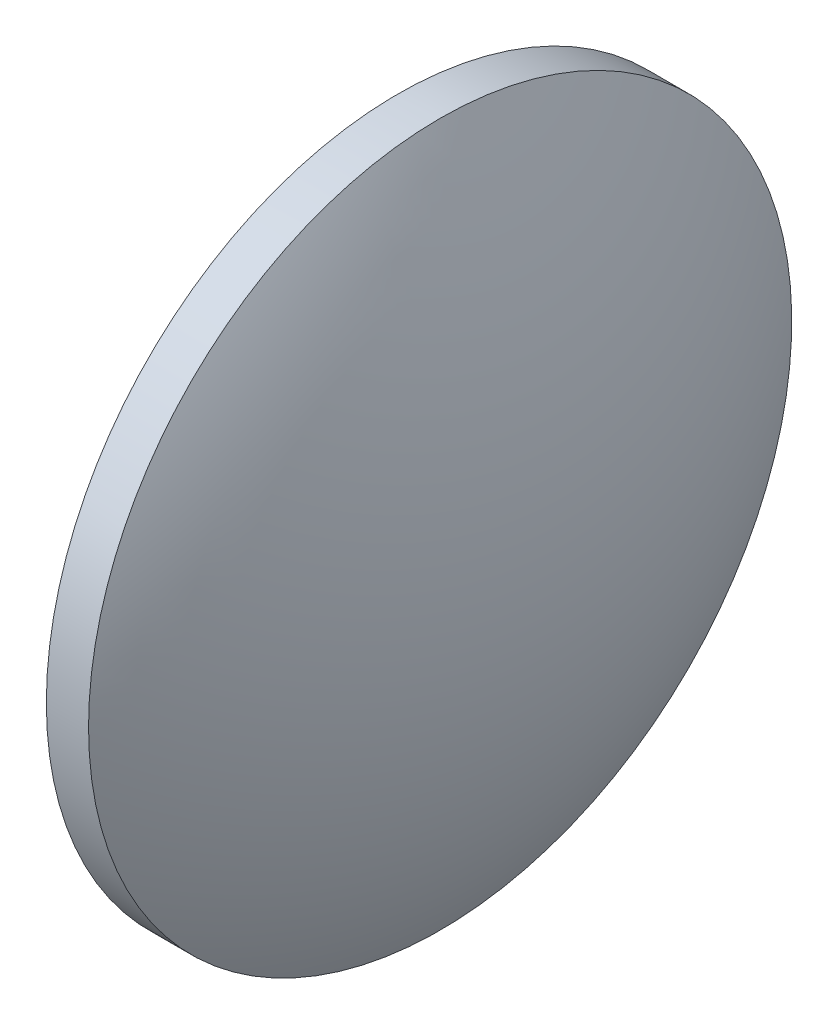
ISO-10303-21;
HEADER;
FILE_DESCRIPTION(('STEP AP214'),'2;1');
FILE_NAME('part.step','',(''),(''),'','','');
FILE_SCHEMA(('AUTOMOTIVE_DESIGN { 1 0 10303 214 1 1 1 1 }'));
ENDSEC;
DATA;
#1=APPLICATION_CONTEXT('core data for automotive mechanical design processes');
#2=APPLICATION_PROTOCOL_DEFINITION('international standard','automotive_design',2000,#1);
#3=PRODUCT_CONTEXT('',#1,'mechanical');
#4=PRODUCT('Part','Part','',(#3));
#5=PRODUCT_RELATED_PRODUCT_CATEGORY('part','',(#4));
#6=PRODUCT_DEFINITION_FORMATION('','',#4);
#7=PRODUCT_DEFINITION_CONTEXT('part definition',#1,'design');
#8=PRODUCT_DEFINITION('design','',#6,#7);
#9=PRODUCT_DEFINITION_SHAPE('','',#8);
#10=(LENGTH_UNIT() NAMED_UNIT(*) SI_UNIT(.MILLI.,.METRE.));
#11=(NAMED_UNIT(*) PLANE_ANGLE_UNIT() SI_UNIT($,.RADIAN.));
#12=(NAMED_UNIT(*) SI_UNIT($,.STERADIAN.) SOLID_ANGLE_UNIT());
#13=UNCERTAINTY_MEASURE_WITH_UNIT(LENGTH_MEASURE(1.E-05),#10,'distance_accuracy_value','');
#14=(GEOMETRIC_REPRESENTATION_CONTEXT(3) GLOBAL_UNCERTAINTY_ASSIGNED_CONTEXT((#13)) GLOBAL_UNIT_ASSIGNED_CONTEXT((#10,
#11,#12)) REPRESENTATION_CONTEXT('',''));
#15=CARTESIAN_POINT('',(0.,0.,0.));
#16=DIRECTION('',(0.,0.,1.));
#17=DIRECTION('',(1.,0.,0.));
#18=AXIS2_PLACEMENT_3D('',#15,#16,#17);
#19=CARTESIAN_POINT('',(301.059857726341,9.63258918567476,0.));
#20=DIRECTION('',(-1.,0.,0.));
#21=DIRECTION('',(0.,1.,0.));
#22=AXIS2_PLACEMENT_3D('',#19,#20,#21);
#23=SPHERICAL_SURFACE('',#22,51.6746124031008);
#24=CARTESIAN_POINT('',(346.284470129442,9.63258918567476,0.));
#25=DIRECTION('',(-1.,0.,0.));
#26=DIRECTION('',(0.,0.,1.));
#27=AXIS2_PLACEMENT_3D('',#24,#25,#26);
#28=CIRCLE('',#27,25.);
#29=CARTESIAN_POINT('',(346.284470129442,9.63258918567476,25.));
#30=VERTEX_POINT('',#29);
#31=EDGE_CURVE('E10',#30,#30,#28,.T.);
#32=ORIENTED_EDGE('',*,*,#31,.F.);
#33=EDGE_LOOP('',(#32));
#34=FACE_BOUND('',#33,.T.);
#35=ADVANCED_FACE('F35',(#34),#23,.T.);
#36=CARTESIAN_POINT('',(339.312694840326,9.63258918567476,0.));
#37=DIRECTION('',(-1.,0.,0.));
#38=DIRECTION('',(0.,0.,1.));
#39=AXIS2_PLACEMENT_3D('',#36,#37,#38);
#40=CYLINDRICAL_SURFACE('',#39,25.);
#41=CARTESIAN_POINT('',(343.284470129442,9.63258918567476,0.));
#42=DIRECTION('',(-1.,0.,0.));
#43=DIRECTION('',(0.,0.,1.));
#44=AXIS2_PLACEMENT_3D('',#41,#42,#43);
#45=CIRCLE('',#44,25.);
#46=CARTESIAN_POINT('',(343.284470129442,9.63258918567476,25.));
#47=VERTEX_POINT('',#46);
#48=EDGE_CURVE('E41',#47,#47,#45,.T.);
#49=ORIENTED_EDGE('',*,*,#48,.F.);
#50=EDGE_LOOP('',(#49));
#51=FACE_BOUND('',#50,.T.);
#52=ORIENTED_EDGE('',*,*,#31,.T.);
#53=EDGE_LOOP('',(#52));
#54=FACE_BOUND('',#53,.T.);
#55=ADVANCED_FACE('F49',(#51,#54),#40,.T.);
#56=CARTESIAN_POINT('',(343.284470129442,9.63258918567476,0.));
#57=DIRECTION('',(1.,0.,0.));
#58=DIRECTION('',(0.,0.,-1.));
#59=AXIS2_PLACEMENT_3D('',#56,#57,#58);
#60=PLANE('',#59);
#61=ORIENTED_EDGE('',*,*,#48,.T.);
#62=EDGE_LOOP('',(#61));
#63=FACE_BOUND('',#62,.T.);
#64=ADVANCED_FACE('F47',(#63),#60,.F.);
#65=CLOSED_SHELL('',(#35,#55,#64));
#66=MANIFOLD_SOLID_BREP('B2',#65);
#67=ADVANCED_BREP_SHAPE_REPRESENTATION('',(#18,#66),#14);
#68=SHAPE_DEFINITION_REPRESENTATION(#9,#67);
ENDSEC;
END-ISO-10303-21;
